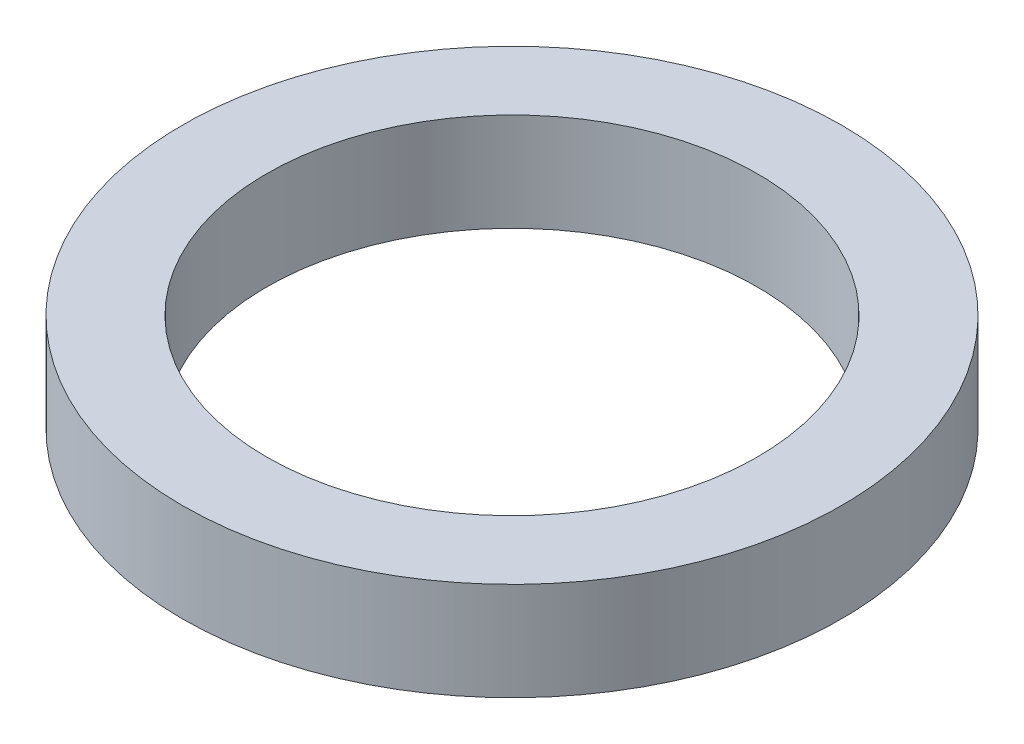
ISO-10303-21;
HEADER;
FILE_DESCRIPTION(('STEP AP214'),'2;1');
FILE_NAME('part.step','',(''),(''),'','','');
FILE_SCHEMA(('AUTOMOTIVE_DESIGN { 1 0 10303 214 1 1 1 1 }'));
ENDSEC;
DATA;
#1=APPLICATION_CONTEXT('core data for automotive mechanical design processes');
#2=APPLICATION_PROTOCOL_DEFINITION('international standard','automotive_design',2000,#1);
#3=PRODUCT_CONTEXT('',#1,'mechanical');
#4=PRODUCT('Part','Part','',(#3));
#5=PRODUCT_RELATED_PRODUCT_CATEGORY('part','',(#4));
#6=PRODUCT_DEFINITION_FORMATION('','',#4);
#7=PRODUCT_DEFINITION_CONTEXT('part definition',#1,'design');
#8=PRODUCT_DEFINITION('design','',#6,#7);
#9=PRODUCT_DEFINITION_SHAPE('','',#8);
#10=(LENGTH_UNIT() NAMED_UNIT(*) SI_UNIT(.MILLI.,.METRE.));
#11=(NAMED_UNIT(*) PLANE_ANGLE_UNIT() SI_UNIT($,.RADIAN.));
#12=(NAMED_UNIT(*) SI_UNIT($,.STERADIAN.) SOLID_ANGLE_UNIT());
#13=UNCERTAINTY_MEASURE_WITH_UNIT(LENGTH_MEASURE(1.E-05),#10,'distance_accuracy_value','');
#14=(GEOMETRIC_REPRESENTATION_CONTEXT(3) GLOBAL_UNCERTAINTY_ASSIGNED_CONTEXT((#13)) GLOBAL_UNIT_ASSIGNED_CONTEXT((#10,
#11,#12)) REPRESENTATION_CONTEXT('',''));
#15=CARTESIAN_POINT('',(0.,0.,0.));
#16=DIRECTION('',(0.,0.,1.));
#17=DIRECTION('',(1.,0.,0.));
#18=AXIS2_PLACEMENT_3D('',#15,#16,#17);
#19=CARTESIAN_POINT('',(0.,7.,0.));
#20=DIRECTION('',(0.,1.,0.));
#21=DIRECTION('',(0.,0.,1.));
#22=AXIS2_PLACEMENT_3D('',#19,#20,#21);
#23=PLANE('',#22);
#24=CARTESIAN_POINT('',(0.,7.,0.));
#25=DIRECTION('',(0.,1.,0.));
#26=DIRECTION('',(0.,0.,1.));
#27=AXIS2_PLACEMENT_3D('',#24,#25,#26);
#28=CIRCLE('',#27,23.5);
#29=CARTESIAN_POINT('',(0.,7.,23.5));
#30=VERTEX_POINT('',#29);
#31=EDGE_CURVE('E10',#30,#30,#28,.T.);
#32=ORIENTED_EDGE('',*,*,#31,.T.);
#33=EDGE_LOOP('',(#32));
#34=FACE_BOUND('',#33,.T.);
#35=CARTESIAN_POINT('',(0.,7.,0.));
#36=DIRECTION('',(0.,1.,0.));
#37=DIRECTION('',(0.,0.,1.));
#38=AXIS2_PLACEMENT_3D('',#35,#36,#37);
#39=CIRCLE('',#38,17.5);
#40=CARTESIAN_POINT('',(0.,7.,17.5));
#41=VERTEX_POINT('',#40);
#42=EDGE_CURVE('E43',#41,#41,#39,.T.);
#43=ORIENTED_EDGE('',*,*,#42,.F.);
#44=EDGE_LOOP('',(#43));
#45=FACE_BOUND('',#44,.T.);
#46=ADVANCED_FACE('F32',(#34,#45),#23,.T.);
#47=CARTESIAN_POINT('',(0.,0.,0.));
#48=DIRECTION('',(0.,1.,0.));
#49=DIRECTION('',(0.,0.,1.));
#50=AXIS2_PLACEMENT_3D('',#47,#48,#49);
#51=PLANE('',#50);
#52=CARTESIAN_POINT('',(0.,0.,0.));
#53=DIRECTION('',(0.,1.,0.));
#54=DIRECTION('',(0.,0.,1.));
#55=AXIS2_PLACEMENT_3D('',#52,#53,#54);
#56=CIRCLE('',#55,23.5);
#57=CARTESIAN_POINT('',(0.,0.,23.5));
#58=VERTEX_POINT('',#57);
#59=EDGE_CURVE('E36',#58,#58,#56,.T.);
#60=ORIENTED_EDGE('',*,*,#59,.F.);
#61=EDGE_LOOP('',(#60));
#62=FACE_BOUND('',#61,.T.);
#63=CARTESIAN_POINT('',(0.,0.,0.));
#64=DIRECTION('',(0.,1.,0.));
#65=DIRECTION('',(0.,0.,1.));
#66=AXIS2_PLACEMENT_3D('',#63,#64,#65);
#67=CIRCLE('',#66,17.5);
#68=CARTESIAN_POINT('',(0.,0.,17.5));
#69=VERTEX_POINT('',#68);
#70=EDGE_CURVE('E45',#69,#69,#67,.T.);
#71=ORIENTED_EDGE('',*,*,#70,.T.);
#72=EDGE_LOOP('',(#71));
#73=FACE_BOUND('',#72,.T.);
#74=ADVANCED_FACE('F55',(#62,#73),#51,.F.);
#75=CARTESIAN_POINT('',(0.,7.,0.));
#76=DIRECTION('',(0.,-1.,0.));
#77=DIRECTION('',(0.,0.,-1.));
#78=AXIS2_PLACEMENT_3D('',#75,#76,#77);
#79=CYLINDRICAL_SURFACE('',#78,23.5);
#80=ORIENTED_EDGE('',*,*,#31,.F.);
#81=EDGE_LOOP('',(#80));
#82=FACE_BOUND('',#81,.T.);
#83=ORIENTED_EDGE('',*,*,#59,.T.);
#84=EDGE_LOOP('',(#83));
#85=FACE_BOUND('',#84,.T.);
#86=ADVANCED_FACE('F34',(#82,#85),#79,.T.);
#87=CARTESIAN_POINT('',(0.,7.,0.));
#88=DIRECTION('',(0.,-1.,0.));
#89=DIRECTION('',(0.,0.,-1.));
#90=AXIS2_PLACEMENT_3D('',#87,#88,#89);
#91=CYLINDRICAL_SURFACE('',#90,17.5);
#92=ORIENTED_EDGE('',*,*,#42,.T.);
#93=EDGE_LOOP('',(#92));
#94=FACE_BOUND('',#93,.T.);
#95=ORIENTED_EDGE('',*,*,#70,.F.);
#96=EDGE_LOOP('',(#95));
#97=FACE_BOUND('',#96,.T.);
#98=ADVANCED_FACE('F51',(#94,#97),#91,.F.);
#99=CLOSED_SHELL('',(#46,#74,#86,#98));
#100=MANIFOLD_SOLID_BREP('B2',#99);
#101=ADVANCED_BREP_SHAPE_REPRESENTATION('',(#18,#100),#14);
#102=SHAPE_DEFINITION_REPRESENTATION(#9,#101);
ENDSEC;
END-ISO-10303-21;
